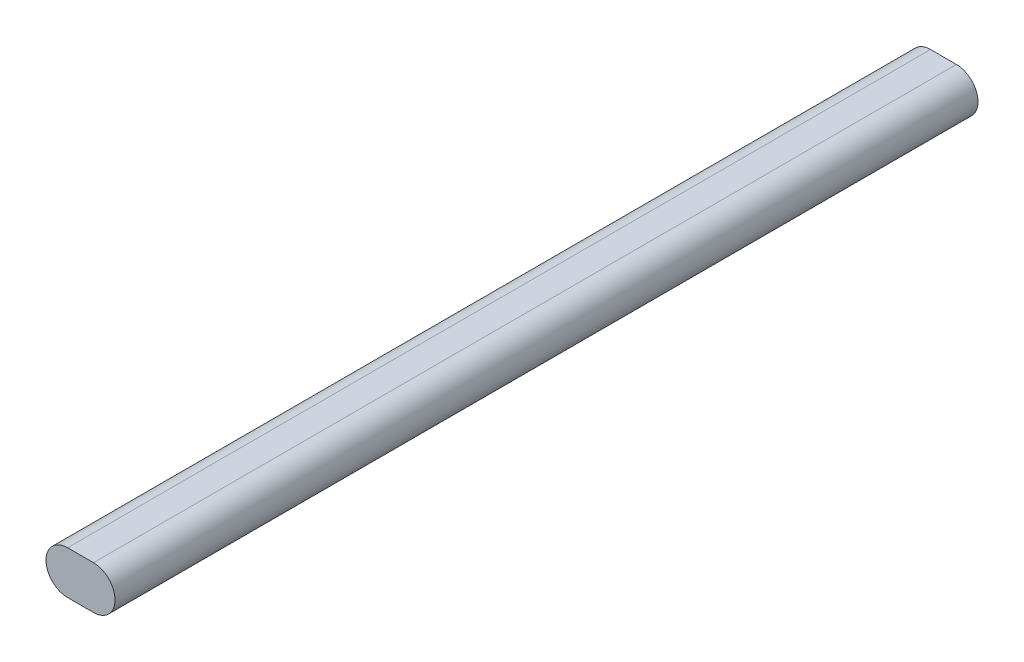
ISO-10303-21;
HEADER;
FILE_DESCRIPTION(('STEP AP214'),'2;1');
FILE_NAME('part.step','',(''),(''),'','','');
FILE_SCHEMA(('AUTOMOTIVE_DESIGN { 1 0 10303 214 1 1 1 1 }'));
ENDSEC;
DATA;
#1=APPLICATION_CONTEXT('core data for automotive mechanical design processes');
#2=APPLICATION_PROTOCOL_DEFINITION('international standard','automotive_design',2000,#1);
#3=PRODUCT_CONTEXT('',#1,'mechanical');
#4=PRODUCT('Part','Part','',(#3));
#5=PRODUCT_RELATED_PRODUCT_CATEGORY('part','',(#4));
#6=PRODUCT_DEFINITION_FORMATION('','',#4);
#7=PRODUCT_DEFINITION_CONTEXT('part definition',#1,'design');
#8=PRODUCT_DEFINITION('design','',#6,#7);
#9=PRODUCT_DEFINITION_SHAPE('','',#8);
#10=(LENGTH_UNIT() NAMED_UNIT(*) SI_UNIT(.MILLI.,.METRE.));
#11=(NAMED_UNIT(*) PLANE_ANGLE_UNIT() SI_UNIT($,.RADIAN.));
#12=(NAMED_UNIT(*) SI_UNIT($,.STERADIAN.) SOLID_ANGLE_UNIT());
#13=UNCERTAINTY_MEASURE_WITH_UNIT(LENGTH_MEASURE(1.E-05),#10,'distance_accuracy_value','');
#14=(GEOMETRIC_REPRESENTATION_CONTEXT(3) GLOBAL_UNCERTAINTY_ASSIGNED_CONTEXT((#13)) GLOBAL_UNIT_ASSIGNED_CONTEXT((#10,
#11,#12)) REPRESENTATION_CONTEXT('',''));
#15=CARTESIAN_POINT('',(0.,0.,0.));
#16=DIRECTION('',(0.,0.,1.));
#17=DIRECTION('',(1.,0.,0.));
#18=AXIS2_PLACEMENT_3D('',#15,#16,#17);
#19=CARTESIAN_POINT('',(-7.49999999999999,0.,500.));
#20=DIRECTION('',(0.,0.,-1.));
#21=DIRECTION('',(-1.,0.,0.));
#22=AXIS2_PLACEMENT_3D('',#19,#20,#21);
#23=CYLINDRICAL_SURFACE('',#22,12.5);
#24=CARTESIAN_POINT('',(-7.49999999999999,0.,0.));
#25=DIRECTION('',(0.,0.,1.));
#26=DIRECTION('',(1.,0.,0.));
#27=AXIS2_PLACEMENT_3D('',#24,#25,#26);
#28=CIRCLE('',#27,12.5);
#29=CARTESIAN_POINT('',(-7.49999999999999,12.5,0.));
#30=VERTEX_POINT('',#29);
#31=CARTESIAN_POINT('',(-7.49999999999999,-12.5,0.));
#32=VERTEX_POINT('',#31);
#33=EDGE_CURVE('E96',#30,#32,#28,.T.);
#34=ORIENTED_EDGE('',*,*,#33,.T.);
#35=DIRECTION('',(0.,0.,-1.));
#36=VECTOR('',#35,1.);
#37=CARTESIAN_POINT('',(-7.49999999999999,-12.5,500.));
#38=LINE('',#37,#36);
#39=CARTESIAN_POINT('',(-7.49999999999999,-12.5,500.));
#40=VERTEX_POINT('',#39);
#41=EDGE_CURVE('E11',#40,#32,#38,.T.);
#42=ORIENTED_EDGE('',*,*,#41,.F.);
#43=CARTESIAN_POINT('',(-7.49999999999999,0.,500.));
#44=DIRECTION('',(0.,0.,1.));
#45=DIRECTION('',(1.,0.,0.));
#46=AXIS2_PLACEMENT_3D('',#43,#44,#45);
#47=CIRCLE('',#46,12.5);
#48=CARTESIAN_POINT('',(-7.49999999999999,12.5,500.));
#49=VERTEX_POINT('',#48);
#50=EDGE_CURVE('E84',#49,#40,#47,.T.);
#51=ORIENTED_EDGE('',*,*,#50,.F.);
#52=DIRECTION('',(0.,0.,-1.));
#53=VECTOR('',#52,1.);
#54=CARTESIAN_POINT('',(-7.49999999999999,12.5,500.));
#55=LINE('',#54,#53);
#56=EDGE_CURVE('E92',#49,#30,#55,.T.);
#57=ORIENTED_EDGE('',*,*,#56,.T.);
#58=EDGE_LOOP('',(#34,#42,#51,#57));
#59=FACE_BOUND('',#58,.T.);
#60=ADVANCED_FACE('F33',(#59),#23,.T.);
#61=CARTESIAN_POINT('',(-7.49999999999999,-12.5,500.));
#62=DIRECTION('',(0.,1.,0.));
#63=DIRECTION('',(0.,0.,1.));
#64=AXIS2_PLACEMENT_3D('',#61,#62,#63);
#65=PLANE('',#64);
#66=DIRECTION('',(1.,0.,0.));
#67=VECTOR('',#66,1.);
#68=CARTESIAN_POINT('',(-7.49999999999999,-12.5,0.));
#69=LINE('',#68,#67);
#70=CARTESIAN_POINT('',(7.49999999999999,-12.5,0.));
#71=VERTEX_POINT('',#70);
#72=EDGE_CURVE('E88',#32,#71,#69,.T.);
#73=ORIENTED_EDGE('',*,*,#72,.T.);
#74=DIRECTION('',(0.,0.,-1.));
#75=VECTOR('',#74,1.);
#76=CARTESIAN_POINT('',(7.49999999999999,-12.5,500.));
#77=LINE('',#76,#75);
#78=CARTESIAN_POINT('',(7.49999999999999,-12.5,500.));
#79=VERTEX_POINT('',#78);
#80=EDGE_CURVE('E41',#79,#71,#77,.T.);
#81=ORIENTED_EDGE('',*,*,#80,.F.);
#82=DIRECTION('',(1.,0.,0.));
#83=VECTOR('',#82,1.);
#84=CARTESIAN_POINT('',(-7.49999999999999,-12.5,500.));
#85=LINE('',#84,#83);
#86=EDGE_CURVE('E79',#40,#79,#85,.T.);
#87=ORIENTED_EDGE('',*,*,#86,.F.);
#88=ORIENTED_EDGE('',*,*,#41,.T.);
#89=EDGE_LOOP('',(#73,#81,#87,#88));
#90=FACE_BOUND('',#89,.T.);
#91=ADVANCED_FACE('F87',(#90),#65,.F.);
#92=CARTESIAN_POINT('',(7.5,0.,500.));
#93=DIRECTION('',(0.,0.,-1.));
#94=DIRECTION('',(-1.,0.,0.));
#95=AXIS2_PLACEMENT_3D('',#92,#93,#94);
#96=CYLINDRICAL_SURFACE('',#95,12.5);
#97=CARTESIAN_POINT('',(7.5,0.,0.));
#98=DIRECTION('',(0.,0.,1.));
#99=DIRECTION('',(1.,0.,0.));
#100=AXIS2_PLACEMENT_3D('',#97,#98,#99);
#101=CIRCLE('',#100,12.5);
#102=CARTESIAN_POINT('',(7.49999999999999,12.5,0.));
#103=VERTEX_POINT('',#102);
#104=EDGE_CURVE('E66',#71,#103,#101,.T.);
#105=ORIENTED_EDGE('',*,*,#104,.T.);
#106=DIRECTION('',(0.,0.,-1.));
#107=VECTOR('',#106,1.);
#108=CARTESIAN_POINT('',(7.49999999999999,12.5,500.));
#109=LINE('',#108,#107);
#110=CARTESIAN_POINT('',(7.49999999999999,12.5,500.));
#111=VERTEX_POINT('',#110);
#112=EDGE_CURVE('E89',#111,#103,#109,.T.);
#113=ORIENTED_EDGE('',*,*,#112,.F.);
#114=CARTESIAN_POINT('',(7.5,0.,500.));
#115=DIRECTION('',(0.,0.,1.));
#116=DIRECTION('',(1.,0.,0.));
#117=AXIS2_PLACEMENT_3D('',#114,#115,#116);
#118=CIRCLE('',#117,12.5);
#119=EDGE_CURVE('E82',#79,#111,#118,.T.);
#120=ORIENTED_EDGE('',*,*,#119,.F.);
#121=ORIENTED_EDGE('',*,*,#80,.T.);
#122=EDGE_LOOP('',(#105,#113,#120,#121));
#123=FACE_BOUND('',#122,.T.);
#124=ADVANCED_FACE('F90',(#123),#96,.T.);
#125=CARTESIAN_POINT('',(-7.49999999999999,12.5,500.));
#126=DIRECTION('',(0.,-1.,0.));
#127=DIRECTION('',(0.,0.,-1.));
#128=AXIS2_PLACEMENT_3D('',#125,#126,#127);
#129=PLANE('',#128);
#130=DIRECTION('',(-1.,0.,0.));
#131=VECTOR('',#130,1.);
#132=CARTESIAN_POINT('',(-7.49999999999999,12.5,0.));
#133=LINE('',#132,#131);
#134=EDGE_CURVE('E72',#103,#30,#133,.T.);
#135=ORIENTED_EDGE('',*,*,#134,.T.);
#136=ORIENTED_EDGE('',*,*,#56,.F.);
#137=DIRECTION('',(-1.,0.,0.));
#138=VECTOR('',#137,1.);
#139=CARTESIAN_POINT('',(-7.49999999999999,12.5,500.));
#140=LINE('',#139,#138);
#141=EDGE_CURVE('E49',#111,#49,#140,.T.);
#142=ORIENTED_EDGE('',*,*,#141,.F.);
#143=ORIENTED_EDGE('',*,*,#112,.T.);
#144=EDGE_LOOP('',(#135,#136,#142,#143));
#145=FACE_BOUND('',#144,.T.);
#146=ADVANCED_FACE('F103',(#145),#129,.F.);
#147=CARTESIAN_POINT('',(-7.49999999999999,0.,500.));
#148=DIRECTION('',(0.,0.,1.));
#149=DIRECTION('',(1.,0.,0.));
#150=AXIS2_PLACEMENT_3D('',#147,#148,#149);
#151=PLANE('',#150);
#152=ORIENTED_EDGE('',*,*,#50,.T.);
#153=ORIENTED_EDGE('',*,*,#86,.T.);
#154=ORIENTED_EDGE('',*,*,#119,.T.);
#155=ORIENTED_EDGE('',*,*,#141,.T.);
#156=EDGE_LOOP('',(#152,#153,#154,#155));
#157=FACE_BOUND('',#156,.T.);
#158=ADVANCED_FACE('F80',(#157),#151,.T.);
#159=CARTESIAN_POINT('',(-7.49999999999999,0.,0.));
#160=DIRECTION('',(0.,0.,1.));
#161=DIRECTION('',(1.,0.,0.));
#162=AXIS2_PLACEMENT_3D('',#159,#160,#161);
#163=PLANE('',#162);
#164=ORIENTED_EDGE('',*,*,#33,.F.);
#165=ORIENTED_EDGE('',*,*,#134,.F.);
#166=ORIENTED_EDGE('',*,*,#104,.F.);
#167=ORIENTED_EDGE('',*,*,#72,.F.);
#168=EDGE_LOOP('',(#164,#165,#166,#167));
#169=FACE_BOUND('',#168,.T.);
#170=ADVANCED_FACE('F106',(#169),#163,.F.);
#171=CLOSED_SHELL('',(#60,#91,#124,#146,#158,#170));
#172=MANIFOLD_SOLID_BREP('B2',#171);
#173=ADVANCED_BREP_SHAPE_REPRESENTATION('',(#18,#172),#14);
#174=SHAPE_DEFINITION_REPRESENTATION(#9,#173);
ENDSEC;
END-ISO-10303-21;
